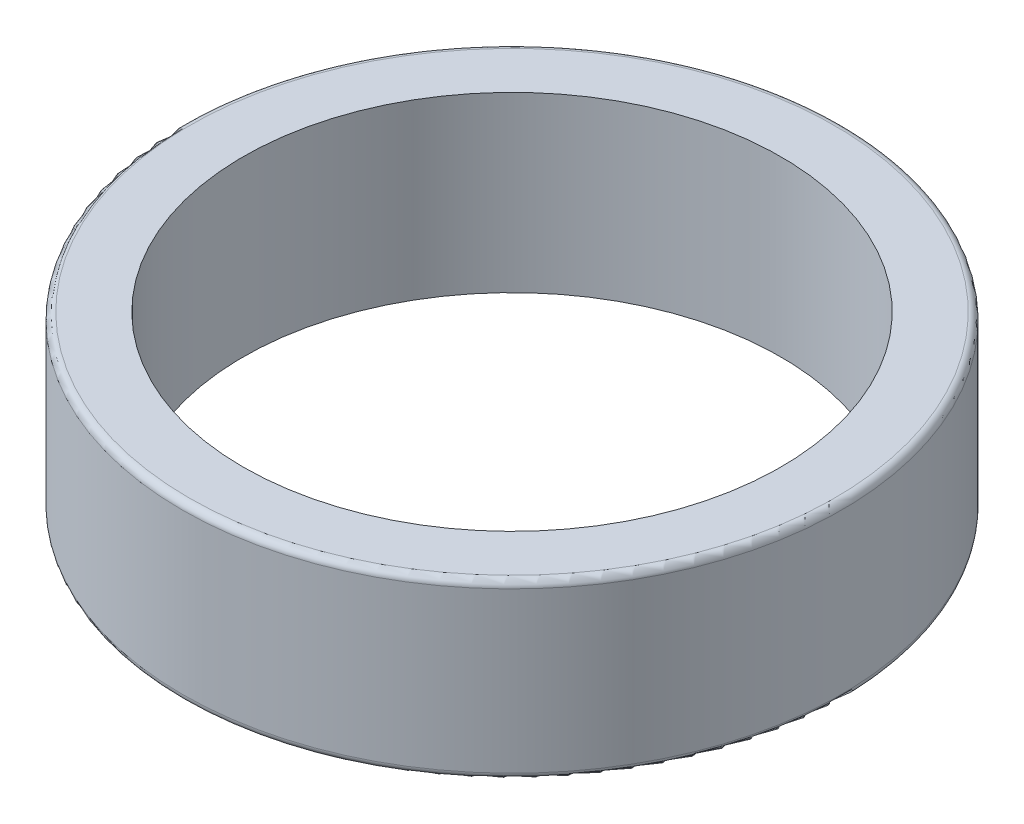
ISO-10303-21;
HEADER;
FILE_DESCRIPTION(('STEP AP214'),'2;1');
FILE_NAME('part.step','',(''),(''),'','','');
FILE_SCHEMA(('AUTOMOTIVE_DESIGN { 1 0 10303 214 1 1 1 1 }'));
ENDSEC;
DATA;
#1=APPLICATION_CONTEXT('core data for automotive mechanical design processes');
#2=APPLICATION_PROTOCOL_DEFINITION('international standard','automotive_design',2000,#1);
#3=PRODUCT_CONTEXT('',#1,'mechanical');
#4=PRODUCT('Part','Part','',(#3));
#5=PRODUCT_RELATED_PRODUCT_CATEGORY('part','',(#4));
#6=PRODUCT_DEFINITION_FORMATION('','',#4);
#7=PRODUCT_DEFINITION_CONTEXT('part definition',#1,'design');
#8=PRODUCT_DEFINITION('design','',#6,#7);
#9=PRODUCT_DEFINITION_SHAPE('','',#8);
#10=(LENGTH_UNIT() NAMED_UNIT(*) SI_UNIT(.MILLI.,.METRE.));
#11=(NAMED_UNIT(*) PLANE_ANGLE_UNIT() SI_UNIT($,.RADIAN.));
#12=(NAMED_UNIT(*) SI_UNIT($,.STERADIAN.) SOLID_ANGLE_UNIT());
#13=UNCERTAINTY_MEASURE_WITH_UNIT(LENGTH_MEASURE(1.E-05),#10,'distance_accuracy_value','');
#14=(GEOMETRIC_REPRESENTATION_CONTEXT(3) GLOBAL_UNCERTAINTY_ASSIGNED_CONTEXT((#13)) GLOBAL_UNIT_ASSIGNED_CONTEXT((#10,
#11,#12)) REPRESENTATION_CONTEXT('',''));
#15=CARTESIAN_POINT('',(0.,0.,0.));
#16=DIRECTION('',(0.,0.,1.));
#17=DIRECTION('',(1.,0.,0.));
#18=AXIS2_PLACEMENT_3D('',#15,#16,#17);
#19=CARTESIAN_POINT('',(0.,5.,0.));
#20=DIRECTION('',(0.,1.,0.));
#21=DIRECTION('',(0.,0.,1.));
#22=AXIS2_PLACEMENT_3D('',#19,#20,#21);
#23=PLANE('',#22);
#24=CARTESIAN_POINT('',(0.,5.,0.));
#25=DIRECTION('',(0.,1.,0.));
#26=DIRECTION('',(0.,0.,1.));
#27=AXIS2_PLACEMENT_3D('',#24,#25,#26);
#28=CIRCLE('',#27,9.3);
#29=CARTESIAN_POINT('',(0.,5.,9.3));
#30=VERTEX_POINT('',#29);
#31=EDGE_CURVE('E10',#30,#30,#28,.T.);
#32=ORIENTED_EDGE('',*,*,#31,.T.);
#33=EDGE_LOOP('',(#32));
#34=FACE_BOUND('',#33,.T.);
#35=CARTESIAN_POINT('',(0.,5.,0.));
#36=DIRECTION('',(0.,1.,0.));
#37=DIRECTION('',(0.,0.,1.));
#38=AXIS2_PLACEMENT_3D('',#35,#36,#37);
#39=CIRCLE('',#38,7.75);
#40=CARTESIAN_POINT('',(0.,5.,7.75));
#41=VERTEX_POINT('',#40);
#42=EDGE_CURVE('E65',#41,#41,#39,.T.);
#43=ORIENTED_EDGE('',*,*,#42,.F.);
#44=EDGE_LOOP('',(#43));
#45=FACE_BOUND('',#44,.T.);
#46=ADVANCED_FACE('F41',(#34,#45),#23,.T.);
#47=CARTESIAN_POINT('',(0.,0.,0.));
#48=DIRECTION('',(0.,1.,0.));
#49=DIRECTION('',(0.,0.,1.));
#50=AXIS2_PLACEMENT_3D('',#47,#48,#49);
#51=PLANE('',#50);
#52=CARTESIAN_POINT('',(0.,0.,0.));
#53=DIRECTION('',(0.,1.,0.));
#54=DIRECTION('',(0.,0.,1.));
#55=AXIS2_PLACEMENT_3D('',#52,#53,#54);
#56=CIRCLE('',#55,9.3);
#57=CARTESIAN_POINT('',(0.,0.,9.3));
#58=VERTEX_POINT('',#57);
#59=EDGE_CURVE('E49',#58,#58,#56,.F.);
#60=ORIENTED_EDGE('',*,*,#59,.T.);
#61=EDGE_LOOP('',(#60));
#62=FACE_BOUND('',#61,.T.);
#63=CARTESIAN_POINT('',(0.,0.,0.));
#64=DIRECTION('',(0.,1.,0.));
#65=DIRECTION('',(0.,0.,1.));
#66=AXIS2_PLACEMENT_3D('',#63,#64,#65);
#67=CIRCLE('',#66,7.75);
#68=CARTESIAN_POINT('',(0.,0.,7.75));
#69=VERTEX_POINT('',#68);
#70=EDGE_CURVE('E66',#69,#69,#67,.T.);
#71=ORIENTED_EDGE('',*,*,#70,.T.);
#72=EDGE_LOOP('',(#71));
#73=FACE_BOUND('',#72,.T.);
#74=ADVANCED_FACE('F78',(#62,#73),#51,.F.);
#75=CARTESIAN_POINT('',(0.,5.,0.));
#76=DIRECTION('',(0.,-1.,0.));
#77=DIRECTION('',(0.,0.,-1.));
#78=AXIS2_PLACEMENT_3D('',#75,#76,#77);
#79=CYLINDRICAL_SURFACE('',#78,9.5);
#80=CARTESIAN_POINT('',(0.,0.2,0.));
#81=DIRECTION('',(0.,1.,0.));
#82=DIRECTION('',(0.,0.,1.));
#83=AXIS2_PLACEMENT_3D('',#80,#81,#82);
#84=CIRCLE('',#83,9.5);
#85=CARTESIAN_POINT('',(0.,0.2,9.5));
#86=VERTEX_POINT('',#85);
#87=EDGE_CURVE('E54',#86,#86,#84,.T.);
#88=ORIENTED_EDGE('',*,*,#87,.T.);
#89=EDGE_LOOP('',(#88));
#90=FACE_BOUND('',#89,.T.);
#91=CARTESIAN_POINT('',(0.,4.8,0.));
#92=DIRECTION('',(0.,1.,0.));
#93=DIRECTION('',(0.,0.,1.));
#94=AXIS2_PLACEMENT_3D('',#91,#92,#93);
#95=CIRCLE('',#94,9.5);
#96=CARTESIAN_POINT('',(0.,4.8,9.5));
#97=VERTEX_POINT('',#96);
#98=EDGE_CURVE('E59',#97,#97,#95,.F.);
#99=ORIENTED_EDGE('',*,*,#98,.T.);
#100=EDGE_LOOP('',(#99));
#101=FACE_BOUND('',#100,.T.);
#102=ADVANCED_FACE('F83',(#90,#101),#79,.T.);
#103=CARTESIAN_POINT('',(0.,5.,0.));
#104=DIRECTION('',(0.,-1.,0.));
#105=DIRECTION('',(0.,0.,-1.));
#106=AXIS2_PLACEMENT_3D('',#103,#104,#105);
#107=CYLINDRICAL_SURFACE('',#106,7.75);
#108=ORIENTED_EDGE('',*,*,#42,.T.);
#109=EDGE_LOOP('',(#108));
#110=FACE_BOUND('',#109,.T.);
#111=ORIENTED_EDGE('',*,*,#70,.F.);
#112=EDGE_LOOP('',(#111));
#113=FACE_BOUND('',#112,.T.);
#114=ADVANCED_FACE('F74',(#110,#113),#107,.F.);
#115=CARTESIAN_POINT('',(0.,0.2,0.));
#116=DIRECTION('',(0.,1.,0.));
#117=DIRECTION('',(0.,0.,1.));
#118=AXIS2_PLACEMENT_3D('',#115,#116,#117);
#119=TOROIDAL_SURFACE('',#118,9.3,0.2);
#120=ORIENTED_EDGE('',*,*,#59,.F.);
#121=EDGE_LOOP('',(#120));
#122=FACE_BOUND('',#121,.T.);
#123=ORIENTED_EDGE('',*,*,#87,.F.);
#124=EDGE_LOOP('',(#123));
#125=FACE_BOUND('',#124,.T.);
#126=ADVANCED_FACE('F89',(#122,#125),#119,.T.);
#127=CARTESIAN_POINT('',(0.,4.8,0.));
#128=DIRECTION('',(0.,1.,0.));
#129=DIRECTION('',(0.,0.,1.));
#130=AXIS2_PLACEMENT_3D('',#127,#128,#129);
#131=TOROIDAL_SURFACE('',#130,9.3,0.2);
#132=ORIENTED_EDGE('',*,*,#98,.F.);
#133=EDGE_LOOP('',(#132));
#134=FACE_BOUND('',#133,.T.);
#135=ORIENTED_EDGE('',*,*,#31,.F.);
#136=EDGE_LOOP('',(#135));
#137=FACE_BOUND('',#136,.T.);
#138=ADVANCED_FACE('F43',(#134,#137),#131,.T.);
#139=CLOSED_SHELL('',(#46,#74,#102,#114,#126,#138));
#140=MANIFOLD_SOLID_BREP('B2',#139);
#141=ADVANCED_BREP_SHAPE_REPRESENTATION('',(#18,#140),#14);
#142=SHAPE_DEFINITION_REPRESENTATION(#9,#141);
ENDSEC;
END-ISO-10303-21;
